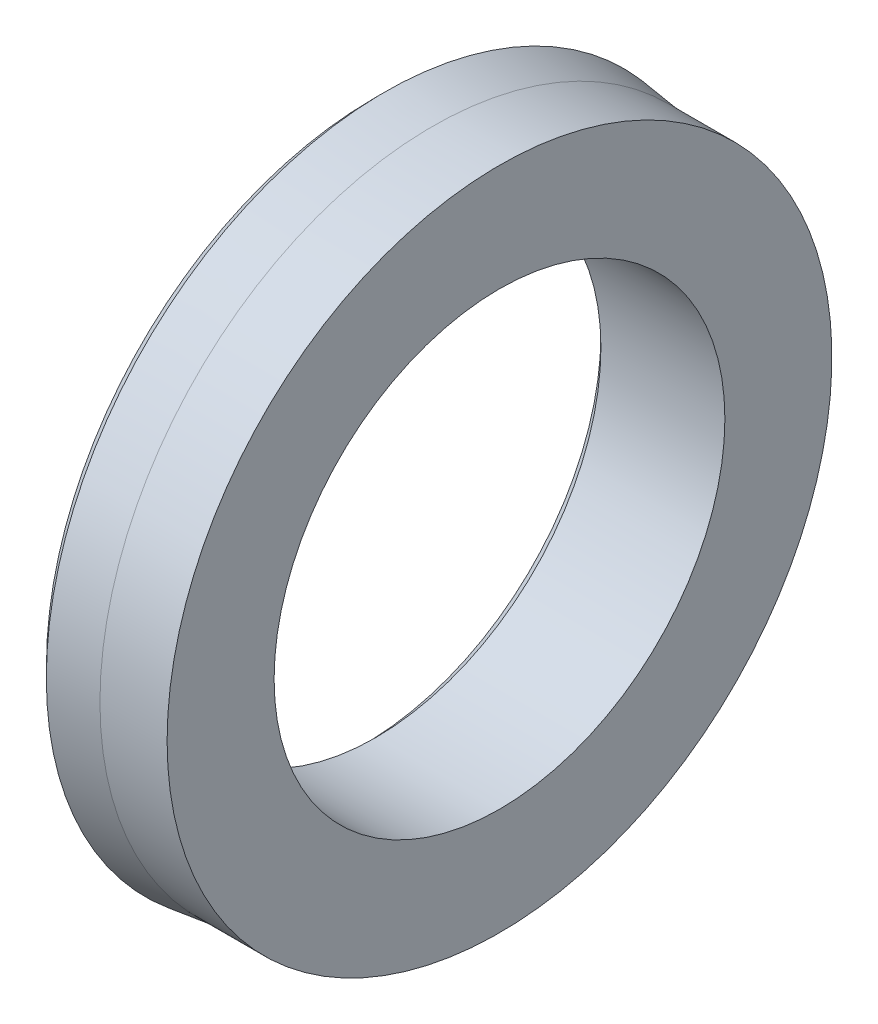
ISO-10303-21;
HEADER;
FILE_DESCRIPTION(('STEP AP214'),'2;1');
FILE_NAME('part.step','',(''),(''),'','','');
FILE_SCHEMA(('AUTOMOTIVE_DESIGN { 1 0 10303 214 1 1 1 1 }'));
ENDSEC;
DATA;
#1=APPLICATION_CONTEXT('core data for automotive mechanical design processes');
#2=APPLICATION_PROTOCOL_DEFINITION('international standard','automotive_design',2000,#1);
#3=PRODUCT_CONTEXT('',#1,'mechanical');
#4=PRODUCT('Part','Part','',(#3));
#5=PRODUCT_RELATED_PRODUCT_CATEGORY('part','',(#4));
#6=PRODUCT_DEFINITION_FORMATION('','',#4);
#7=PRODUCT_DEFINITION_CONTEXT('part definition',#1,'design');
#8=PRODUCT_DEFINITION('design','',#6,#7);
#9=PRODUCT_DEFINITION_SHAPE('','',#8);
#10=(LENGTH_UNIT() NAMED_UNIT(*) SI_UNIT(.MILLI.,.METRE.));
#11=(NAMED_UNIT(*) PLANE_ANGLE_UNIT() SI_UNIT($,.RADIAN.));
#12=(NAMED_UNIT(*) SI_UNIT($,.STERADIAN.) SOLID_ANGLE_UNIT());
#13=UNCERTAINTY_MEASURE_WITH_UNIT(LENGTH_MEASURE(1.E-05),#10,'distance_accuracy_value','');
#14=(GEOMETRIC_REPRESENTATION_CONTEXT(3) GLOBAL_UNCERTAINTY_ASSIGNED_CONTEXT((#13)) GLOBAL_UNIT_ASSIGNED_CONTEXT((#10,
#11,#12)) REPRESENTATION_CONTEXT('',''));
#15=CARTESIAN_POINT('',(0.,0.,0.));
#16=DIRECTION('',(0.,0.,1.));
#17=DIRECTION('',(1.,0.,0.));
#18=AXIS2_PLACEMENT_3D('',#15,#16,#17);
#19=CARTESIAN_POINT('',(0.,0.,0.));
#20=DIRECTION('',(-1.,0.,0.));
#21=DIRECTION('',(0.,0.,1.));
#22=AXIS2_PLACEMENT_3D('',#19,#20,#21);
#23=CYLINDRICAL_SURFACE('',#22,24.);
#24=CARTESIAN_POINT('',(2.98387644141136,0.,0.));
#25=DIRECTION('',(-1.,0.,0.));
#26=DIRECTION('',(0.,0.,1.));
#27=AXIS2_PLACEMENT_3D('',#24,#25,#26);
#28=CIRCLE('',#27,24.);
#29=CARTESIAN_POINT('',(2.98387644141136,0.,24.));
#30=VERTEX_POINT('',#29);
#31=EDGE_CURVE('E10',#30,#30,#28,.T.);
#32=ORIENTED_EDGE('',*,*,#31,.F.);
#33=EDGE_LOOP('',(#32));
#34=FACE_BOUND('',#33,.T.);
#35=CARTESIAN_POINT('',(7.46387644141136,0.,0.));
#36=DIRECTION('',(-1.,0.,0.));
#37=DIRECTION('',(0.,0.,1.));
#38=AXIS2_PLACEMENT_3D('',#35,#36,#37);
#39=CIRCLE('',#38,24.);
#40=CARTESIAN_POINT('',(7.46387644141136,0.,24.));
#41=VERTEX_POINT('',#40);
#42=EDGE_CURVE('E73',#41,#41,#39,.T.);
#43=ORIENTED_EDGE('',*,*,#42,.T.);
#44=EDGE_LOOP('',(#43));
#45=FACE_BOUND('',#44,.T.);
#46=ADVANCED_FACE('F36',(#34,#45),#23,.T.);
#47=CARTESIAN_POINT('',(2.98387644141136,24.,0.));
#48=DIRECTION('',(1.,0.,0.));
#49=DIRECTION('',(0.,0.,-1.));
#50=AXIS2_PLACEMENT_3D('',#47,#48,#49);
#51=PLANE('',#50);
#52=CARTESIAN_POINT('',(2.98387644141136,0.,0.));
#53=DIRECTION('',(-1.,0.,0.));
#54=DIRECTION('',(0.,0.,1.));
#55=AXIS2_PLACEMENT_3D('',#52,#53,#54);
#56=CIRCLE('',#55,21.);
#57=CARTESIAN_POINT('',(2.98387644141136,0.,21.));
#58=VERTEX_POINT('',#57);
#59=EDGE_CURVE('E42',#58,#58,#56,.T.);
#60=ORIENTED_EDGE('',*,*,#59,.F.);
#61=EDGE_LOOP('',(#60));
#62=FACE_BOUND('',#61,.T.);
#63=ORIENTED_EDGE('',*,*,#31,.T.);
#64=EDGE_LOOP('',(#63));
#65=FACE_BOUND('',#64,.T.);
#66=ADVANCED_FACE('F128',(#62,#65),#51,.F.);
#67=CARTESIAN_POINT('',(2.98387644141136,0.,0.));
#68=DIRECTION('',(-1.,0.,0.));
#69=DIRECTION('',(0.,0.,1.));
#70=AXIS2_PLACEMENT_3D('',#67,#68,#69);
#71=CONICAL_SURFACE('',#70,21.,0.78539816339745);
#72=CARTESIAN_POINT('',(3.98387644141136,0.,0.));
#73=DIRECTION('',(-1.,0.,0.));
#74=DIRECTION('',(0.,0.,1.));
#75=AXIS2_PLACEMENT_3D('',#72,#73,#74);
#76=CIRCLE('',#75,20.);
#77=CARTESIAN_POINT('',(3.98387644141136,0.,20.));
#78=VERTEX_POINT('',#77);
#79=EDGE_CURVE('E46',#78,#78,#76,.T.);
#80=ORIENTED_EDGE('',*,*,#79,.F.);
#81=EDGE_LOOP('',(#80));
#82=FACE_BOUND('',#81,.T.);
#83=ORIENTED_EDGE('',*,*,#59,.T.);
#84=EDGE_LOOP('',(#83));
#85=FACE_BOUND('',#84,.T.);
#86=ADVANCED_FACE('F123',(#82,#85),#71,.F.);
#87=CARTESIAN_POINT('',(0.,0.,0.));
#88=DIRECTION('',(-1.,0.,0.));
#89=DIRECTION('',(0.,0.,1.));
#90=AXIS2_PLACEMENT_3D('',#87,#88,#89);
#91=CYLINDRICAL_SURFACE('',#90,20.);
#92=CARTESIAN_POINT('',(14.9838764414114,0.,0.));
#93=DIRECTION('',(-1.,0.,0.));
#94=DIRECTION('',(0.,0.,1.));
#95=AXIS2_PLACEMENT_3D('',#92,#93,#94);
#96=CIRCLE('',#95,20.);
#97=CARTESIAN_POINT('',(14.9838764414114,0.,20.));
#98=VERTEX_POINT('',#97);
#99=EDGE_CURVE('E50',#98,#98,#96,.T.);
#100=ORIENTED_EDGE('',*,*,#99,.F.);
#101=EDGE_LOOP('',(#100));
#102=FACE_BOUND('',#101,.T.);
#103=ORIENTED_EDGE('',*,*,#79,.T.);
#104=EDGE_LOOP('',(#103));
#105=FACE_BOUND('',#104,.T.);
#106=ADVANCED_FACE('F117',(#102,#105),#91,.F.);
#107=CARTESIAN_POINT('',(14.9838764414114,20.,0.));
#108=DIRECTION('',(-1.,0.,0.));
#109=DIRECTION('',(0.,0.,1.));
#110=AXIS2_PLACEMENT_3D('',#107,#108,#109);
#111=PLANE('',#110);
#112=CARTESIAN_POINT('',(14.9838764414114,0.,0.));
#113=DIRECTION('',(-1.,0.,0.));
#114=DIRECTION('',(0.,0.,1.));
#115=AXIS2_PLACEMENT_3D('',#112,#113,#114);
#116=CIRCLE('',#115,29.495);
#117=CARTESIAN_POINT('',(14.9838764414114,0.,29.495));
#118=VERTEX_POINT('',#117);
#119=EDGE_CURVE('E55',#118,#118,#116,.T.);
#120=ORIENTED_EDGE('',*,*,#119,.F.);
#121=EDGE_LOOP('',(#120));
#122=FACE_BOUND('',#121,.T.);
#123=ORIENTED_EDGE('',*,*,#99,.T.);
#124=EDGE_LOOP('',(#123));
#125=FACE_BOUND('',#124,.T.);
#126=ADVANCED_FACE('F111',(#122,#125),#111,.F.);
#127=CARTESIAN_POINT('',(0.,0.,0.));
#128=DIRECTION('',(-1.,0.,0.));
#129=DIRECTION('',(0.,0.,1.));
#130=AXIS2_PLACEMENT_3D('',#127,#128,#129);
#131=CYLINDRICAL_SURFACE('',#130,29.495);
#132=CARTESIAN_POINT('',(9.02387644141136,0.,0.));
#133=DIRECTION('',(-1.,0.,0.));
#134=DIRECTION('',(0.,0.,1.));
#135=AXIS2_PLACEMENT_3D('',#132,#133,#134);
#136=CIRCLE('',#135,29.495);
#137=CARTESIAN_POINT('',(9.02387644141136,0.,29.495));
#138=VERTEX_POINT('',#137);
#139=EDGE_CURVE('E58',#138,#138,#136,.T.);
#140=ORIENTED_EDGE('',*,*,#139,.F.);
#141=EDGE_LOOP('',(#140));
#142=FACE_BOUND('',#141,.T.);
#143=ORIENTED_EDGE('',*,*,#119,.T.);
#144=EDGE_LOOP('',(#143));
#145=FACE_BOUND('',#144,.T.);
#146=ADVANCED_FACE('F105',(#142,#145),#131,.T.);
#147=CARTESIAN_POINT('',(9.02387644141136,0.,0.));
#148=DIRECTION('',(-1.,0.,0.));
#149=DIRECTION('',(0.,0.,1.));
#150=AXIS2_PLACEMENT_3D('',#147,#148,#149);
#151=CONICAL_SURFACE('',#150,29.495,0.121998514714403);
#152=CARTESIAN_POINT('',(4.78387644141136,0.,0.));
#153=DIRECTION('',(-1.,0.,0.));
#154=DIRECTION('',(0.,0.,1.));
#155=AXIS2_PLACEMENT_3D('',#152,#153,#154);
#156=CIRCLE('',#155,30.0148553781438);
#157=CARTESIAN_POINT('',(4.78387644141136,0.,30.0148553781438));
#158=VERTEX_POINT('',#157);
#159=EDGE_CURVE('E61',#158,#158,#156,.T.);
#160=ORIENTED_EDGE('',*,*,#159,.F.);
#161=EDGE_LOOP('',(#160));
#162=FACE_BOUND('',#161,.T.);
#163=ORIENTED_EDGE('',*,*,#139,.T.);
#164=EDGE_LOOP('',(#163));
#165=FACE_BOUND('',#164,.T.);
#166=ADVANCED_FACE('F99',(#162,#165),#151,.T.);
#167=CARTESIAN_POINT('',(4.78387644141136,0.,0.));
#168=DIRECTION('',(1.,0.,0.));
#169=DIRECTION('',(0.,0.,-1.));
#170=AXIS2_PLACEMENT_3D('',#167,#168,#169);
#171=CONICAL_SURFACE('',#170,30.0148553781438,0.792770955079743);
#172=CARTESIAN_POINT('',(3.78387644141136,0.,0.));
#173=DIRECTION('',(-1.,0.,0.));
#174=DIRECTION('',(0.,0.,1.));
#175=AXIS2_PLACEMENT_3D('',#172,#173,#174);
#176=CIRCLE('',#175,29.);
#177=CARTESIAN_POINT('',(3.78387644141136,0.,29.));
#178=VERTEX_POINT('',#177);
#179=EDGE_CURVE('E64',#178,#178,#176,.T.);
#180=ORIENTED_EDGE('',*,*,#179,.F.);
#181=EDGE_LOOP('',(#180));
#182=FACE_BOUND('',#181,.T.);
#183=ORIENTED_EDGE('',*,*,#159,.T.);
#184=EDGE_LOOP('',(#183));
#185=FACE_BOUND('',#184,.T.);
#186=ADVANCED_FACE('F93',(#182,#185),#171,.T.);
#187=CARTESIAN_POINT('',(3.78387644141136,29.,0.));
#188=DIRECTION('',(1.,0.,0.));
#189=DIRECTION('',(0.,0.,-1.));
#190=AXIS2_PLACEMENT_3D('',#187,#188,#189);
#191=PLANE('',#190);
#192=CARTESIAN_POINT('',(3.78387644141136,0.,0.));
#193=DIRECTION('',(-1.,0.,0.));
#194=DIRECTION('',(0.,0.,1.));
#195=AXIS2_PLACEMENT_3D('',#192,#193,#194);
#196=CIRCLE('',#195,26.2457040945283);
#197=CARTESIAN_POINT('',(3.78387644141136,0.,26.2457040945283));
#198=VERTEX_POINT('',#197);
#199=EDGE_CURVE('E67',#198,#198,#196,.T.);
#200=ORIENTED_EDGE('',*,*,#199,.F.);
#201=EDGE_LOOP('',(#200));
#202=FACE_BOUND('',#201,.T.);
#203=ORIENTED_EDGE('',*,*,#179,.T.);
#204=EDGE_LOOP('',(#203));
#205=FACE_BOUND('',#204,.T.);
#206=ADVANCED_FACE('F87',(#202,#205),#191,.F.);
#207=CARTESIAN_POINT('',(3.78387644141136,0.,0.));
#208=DIRECTION('',(-1.,0.,0.));
#209=DIRECTION('',(0.,0.,1.));
#210=AXIS2_PLACEMENT_3D('',#207,#208,#209);
#211=CONICAL_SURFACE('',#210,26.2457040945283,0.121998514714397);
#212=CARTESIAN_POINT('',(7.46387644141136,0.,0.));
#213=DIRECTION('',(-1.,0.,0.));
#214=DIRECTION('',(0.,0.,1.));
#215=AXIS2_PLACEMENT_3D('',#212,#213,#214);
#216=CIRCLE('',#215,25.7945088606677);
#217=CARTESIAN_POINT('',(7.46387644141136,0.,25.7945088606677));
#218=VERTEX_POINT('',#217);
#219=EDGE_CURVE('E70',#218,#218,#216,.T.);
#220=ORIENTED_EDGE('',*,*,#219,.F.);
#221=EDGE_LOOP('',(#220));
#222=FACE_BOUND('',#221,.T.);
#223=ORIENTED_EDGE('',*,*,#199,.T.);
#224=EDGE_LOOP('',(#223));
#225=FACE_BOUND('',#224,.T.);
#226=ADVANCED_FACE('F81',(#222,#225),#211,.F.);
#227=CARTESIAN_POINT('',(7.46387644141136,0.,0.));
#228=DIRECTION('',(-1.,0.,0.));
#229=DIRECTION('',(0.,0.,1.));
#230=AXIS2_PLACEMENT_3D('',#227,#228,#229);
#231=TOROIDAL_SURFACE('',#230,24.8972544303338,0.897254430333829);
#232=ORIENTED_EDGE('',*,*,#42,.F.);
#233=EDGE_LOOP('',(#232));
#234=FACE_BOUND('',#233,.T.);
#235=ORIENTED_EDGE('',*,*,#219,.T.);
#236=EDGE_LOOP('',(#235));
#237=FACE_BOUND('',#236,.T.);
#238=ADVANCED_FACE('F78',(#234,#237),#231,.F.);
#239=CLOSED_SHELL('',(#46,#66,#86,#106,#126,#146,#166,#186,#206,#226,#238));
#240=MANIFOLD_SOLID_BREP('B2',#239);
#241=ADVANCED_BREP_SHAPE_REPRESENTATION('',(#18,#240),#14);
#242=SHAPE_DEFINITION_REPRESENTATION(#9,#241);
ENDSEC;
END-ISO-10303-21;
